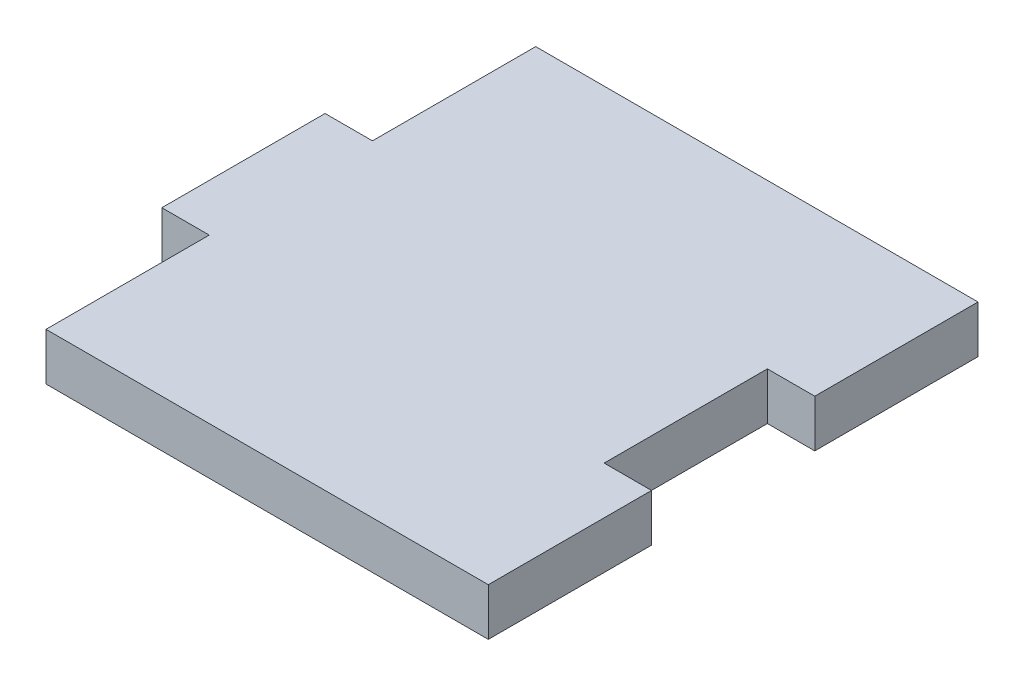
ISO-10303-21;
HEADER;
FILE_DESCRIPTION(('STEP AP214'),'2;1');
FILE_NAME('part.step','',(''),(''),'','','');
FILE_SCHEMA(('AUTOMOTIVE_DESIGN { 1 0 10303 214 1 1 1 1 }'));
ENDSEC;
DATA;
#1=APPLICATION_CONTEXT('core data for automotive mechanical design processes');
#2=APPLICATION_PROTOCOL_DEFINITION('international standard','automotive_design',2000,#1);
#3=PRODUCT_CONTEXT('',#1,'mechanical');
#4=PRODUCT('Part','Part','',(#3));
#5=PRODUCT_RELATED_PRODUCT_CATEGORY('part','',(#4));
#6=PRODUCT_DEFINITION_FORMATION('','',#4);
#7=PRODUCT_DEFINITION_CONTEXT('part definition',#1,'design');
#8=PRODUCT_DEFINITION('design','',#6,#7);
#9=PRODUCT_DEFINITION_SHAPE('','',#8);
#10=(LENGTH_UNIT() NAMED_UNIT(*) SI_UNIT(.MILLI.,.METRE.));
#11=(NAMED_UNIT(*) PLANE_ANGLE_UNIT() SI_UNIT($,.RADIAN.));
#12=(NAMED_UNIT(*) SI_UNIT($,.STERADIAN.) SOLID_ANGLE_UNIT());
#13=UNCERTAINTY_MEASURE_WITH_UNIT(LENGTH_MEASURE(1.E-05),#10,'distance_accuracy_value','');
#14=(GEOMETRIC_REPRESENTATION_CONTEXT(3) GLOBAL_UNCERTAINTY_ASSIGNED_CONTEXT((#13)) GLOBAL_UNIT_ASSIGNED_CONTEXT((#10,
#11,#12)) REPRESENTATION_CONTEXT('',''));
#15=CARTESIAN_POINT('',(0.,0.,0.));
#16=DIRECTION('',(0.,0.,1.));
#17=DIRECTION('',(1.,0.,0.));
#18=AXIS2_PLACEMENT_3D('',#15,#16,#17);
#19=CARTESIAN_POINT('',(-21.,4.5,-31.0000000000017));
#20=DIRECTION('',(1.,0.,0.));
#21=DIRECTION('',(0.,0.,-1.));
#22=AXIS2_PLACEMENT_3D('',#19,#20,#21);
#23=PLANE('',#22);
#24=DIRECTION('',(0.,0.,1.));
#25=VECTOR('',#24,1.);
#26=CARTESIAN_POINT('',(-21.,0.,-31.0000000000017));
#27=LINE('',#26,#25);
#28=CARTESIAN_POINT('',(-21.,0.,-31.0000000000017));
#29=VERTEX_POINT('',#28);
#30=CARTESIAN_POINT('',(-21.0000000000001,0.,-15.5000000000008));
#31=VERTEX_POINT('',#30);
#32=EDGE_CURVE('E240',#29,#31,#27,.T.);
#33=ORIENTED_EDGE('',*,*,#32,.T.);
#34=DIRECTION('',(0.,-1.,0.));
#35=VECTOR('',#34,1.);
#36=CARTESIAN_POINT('',(-21.0000000000001,4.5,-15.5000000000008));
#37=LINE('',#36,#35);
#38=CARTESIAN_POINT('',(-21.0000000000001,4.5,-15.5000000000008));
#39=VERTEX_POINT('',#38);
#40=EDGE_CURVE('E12',#39,#31,#37,.T.);
#41=ORIENTED_EDGE('',*,*,#40,.F.);
#42=DIRECTION('',(0.,0.,1.));
#43=VECTOR('',#42,1.);
#44=CARTESIAN_POINT('',(-21.,4.5,-31.0000000000017));
#45=LINE('',#44,#43);
#46=CARTESIAN_POINT('',(-21.,4.5,-31.0000000000017));
#47=VERTEX_POINT('',#46);
#48=EDGE_CURVE('E166',#47,#39,#45,.T.);
#49=ORIENTED_EDGE('',*,*,#48,.F.);
#50=DIRECTION('',(0.,-1.,0.));
#51=VECTOR('',#50,1.);
#52=CARTESIAN_POINT('',(-21.,4.5,-31.0000000000017));
#53=LINE('',#52,#51);
#54=EDGE_CURVE('E151',#47,#29,#53,.T.);
#55=ORIENTED_EDGE('',*,*,#54,.T.);
#56=EDGE_LOOP('',(#33,#41,#49,#55));
#57=FACE_BOUND('',#56,.T.);
#58=ADVANCED_FACE('F35',(#57),#23,.F.);
#59=CARTESIAN_POINT('',(-25.5000000000001,4.5,-15.5000000000008));
#60=DIRECTION('',(0.,0.,1.));
#61=DIRECTION('',(1.,0.,0.));
#62=AXIS2_PLACEMENT_3D('',#59,#60,#61);
#63=PLANE('',#62);
#64=DIRECTION('',(-1.,0.,0.));
#65=VECTOR('',#64,1.);
#66=CARTESIAN_POINT('',(-25.5000000000001,0.,-15.5000000000008));
#67=LINE('',#66,#65);
#68=CARTESIAN_POINT('',(-25.5000000000001,0.,-15.5000000000008));
#69=VERTEX_POINT('',#68);
#70=EDGE_CURVE('E234',#31,#69,#67,.T.);
#71=ORIENTED_EDGE('',*,*,#70,.T.);
#72=DIRECTION('',(0.,-1.,0.));
#73=VECTOR('',#72,1.);
#74=CARTESIAN_POINT('',(-25.5000000000001,4.5,-15.5000000000008));
#75=LINE('',#74,#73);
#76=CARTESIAN_POINT('',(-25.5000000000001,4.5,-15.5000000000008));
#77=VERTEX_POINT('',#76);
#78=EDGE_CURVE('E43',#77,#69,#75,.T.);
#79=ORIENTED_EDGE('',*,*,#78,.F.);
#80=DIRECTION('',(-1.,0.,0.));
#81=VECTOR('',#80,1.);
#82=CARTESIAN_POINT('',(-25.5000000000001,4.5,-15.5000000000008));
#83=LINE('',#82,#81);
#84=EDGE_CURVE('E107',#39,#77,#83,.T.);
#85=ORIENTED_EDGE('',*,*,#84,.F.);
#86=ORIENTED_EDGE('',*,*,#40,.T.);
#87=EDGE_LOOP('',(#71,#79,#85,#86));
#88=FACE_BOUND('',#87,.T.);
#89=ADVANCED_FACE('F283',(#88),#63,.F.);
#90=CARTESIAN_POINT('',(-25.5000000000001,4.5,-15.5000000000008));
#91=DIRECTION('',(1.,0.,0.));
#92=DIRECTION('',(0.,0.,-1.));
#93=AXIS2_PLACEMENT_3D('',#90,#91,#92);
#94=PLANE('',#93);
#95=DIRECTION('',(0.,0.,1.));
#96=VECTOR('',#95,1.);
#97=CARTESIAN_POINT('',(-25.5000000000001,0.,-15.5000000000008));
#98=LINE('',#97,#96);
#99=CARTESIAN_POINT('',(-25.5,0.,0.));
#100=VERTEX_POINT('',#99);
#101=EDGE_CURVE('E229',#69,#100,#98,.T.);
#102=ORIENTED_EDGE('',*,*,#101,.T.);
#103=DIRECTION('',(0.,-1.,0.));
#104=VECTOR('',#103,1.);
#105=CARTESIAN_POINT('',(-25.5,4.5,0.));
#106=LINE('',#105,#104);
#107=CARTESIAN_POINT('',(-25.5,4.5,0.));
#108=VERTEX_POINT('',#107);
#109=EDGE_CURVE('E221',#108,#100,#106,.T.);
#110=ORIENTED_EDGE('',*,*,#109,.F.);
#111=DIRECTION('',(0.,0.,1.));
#112=VECTOR('',#111,1.);
#113=CARTESIAN_POINT('',(-25.5000000000001,4.5,-15.5000000000008));
#114=LINE('',#113,#112);
#115=EDGE_CURVE('E170',#77,#108,#114,.T.);
#116=ORIENTED_EDGE('',*,*,#115,.F.);
#117=ORIENTED_EDGE('',*,*,#78,.T.);
#118=EDGE_LOOP('',(#102,#110,#116,#117));
#119=FACE_BOUND('',#118,.T.);
#120=ADVANCED_FACE('F227',(#119),#94,.F.);
#121=CARTESIAN_POINT('',(-25.5,4.5,0.));
#122=DIRECTION('',(0.,0.,-1.));
#123=DIRECTION('',(-1.,0.,0.));
#124=AXIS2_PLACEMENT_3D('',#121,#122,#123);
#125=PLANE('',#124);
#126=DIRECTION('',(1.,0.,0.));
#127=VECTOR('',#126,1.);
#128=CARTESIAN_POINT('',(-25.5,0.,0.));
#129=LINE('',#128,#127);
#130=CARTESIAN_POINT('',(-21.,0.,-2.78106847215906E-13));
#131=VERTEX_POINT('',#130);
#132=EDGE_CURVE('E236',#100,#131,#129,.T.);
#133=ORIENTED_EDGE('',*,*,#132,.T.);
#134=DIRECTION('',(0.,-1.,0.));
#135=VECTOR('',#134,1.);
#136=CARTESIAN_POINT('',(-21.,4.5,-2.78106847215906E-13));
#137=LINE('',#136,#135);
#138=CARTESIAN_POINT('',(-21.,4.5,-2.78106847215906E-13));
#139=VERTEX_POINT('',#138);
#140=EDGE_CURVE('E218',#139,#131,#137,.T.);
#141=ORIENTED_EDGE('',*,*,#140,.F.);
#142=DIRECTION('',(1.,0.,0.));
#143=VECTOR('',#142,1.);
#144=CARTESIAN_POINT('',(-25.5,4.5,0.));
#145=LINE('',#144,#143);
#146=EDGE_CURVE('E172',#108,#139,#145,.T.);
#147=ORIENTED_EDGE('',*,*,#146,.F.);
#148=ORIENTED_EDGE('',*,*,#109,.T.);
#149=EDGE_LOOP('',(#133,#141,#147,#148));
#150=FACE_BOUND('',#149,.T.);
#151=ADVANCED_FACE('F262',(#150),#125,.F.);
#152=CARTESIAN_POINT('',(-21.,4.5,-2.78106847215906E-13));
#153=DIRECTION('',(1.,0.,0.));
#154=DIRECTION('',(0.,0.,-1.));
#155=AXIS2_PLACEMENT_3D('',#152,#153,#154);
#156=PLANE('',#155);
#157=DIRECTION('',(0.,0.,1.));
#158=VECTOR('',#157,1.);
#159=CARTESIAN_POINT('',(-21.,0.,-2.78106847215906E-13));
#160=LINE('',#159,#158);
#161=CARTESIAN_POINT('',(-21.,0.,15.5000000000008));
#162=VERTEX_POINT('',#161);
#163=EDGE_CURVE('E238',#131,#162,#160,.T.);
#164=ORIENTED_EDGE('',*,*,#163,.T.);
#165=DIRECTION('',(0.,-1.,0.));
#166=VECTOR('',#165,1.);
#167=CARTESIAN_POINT('',(-21.,4.5,15.5000000000008));
#168=LINE('',#167,#166);
#169=CARTESIAN_POINT('',(-21.,4.5,15.5000000000008));
#170=VERTEX_POINT('',#169);
#171=EDGE_CURVE('E215',#170,#162,#168,.T.);
#172=ORIENTED_EDGE('',*,*,#171,.F.);
#173=DIRECTION('',(0.,0.,1.));
#174=VECTOR('',#173,1.);
#175=CARTESIAN_POINT('',(-21.,4.5,-2.78106847215906E-13));
#176=LINE('',#175,#174);
#177=EDGE_CURVE('E175',#139,#170,#176,.T.);
#178=ORIENTED_EDGE('',*,*,#177,.F.);
#179=ORIENTED_EDGE('',*,*,#140,.T.);
#180=EDGE_LOOP('',(#164,#172,#178,#179));
#181=FACE_BOUND('',#180,.T.);
#182=ADVANCED_FACE('F266',(#181),#156,.F.);
#183=CARTESIAN_POINT('',(16.4999999999993,4.5,15.5000000000008));
#184=DIRECTION('',(0.,0.,-1.));
#185=DIRECTION('',(-1.,0.,0.));
#186=AXIS2_PLACEMENT_3D('',#183,#184,#185);
#187=PLANE('',#186);
#188=DIRECTION('',(1.,0.,0.));
#189=VECTOR('',#188,1.);
#190=CARTESIAN_POINT('',(16.4999999999993,0.,15.5000000000008));
#191=LINE('',#190,#189);
#192=CARTESIAN_POINT('',(21.,0.,15.5000000000008));
#193=VERTEX_POINT('',#192);
#194=EDGE_CURVE('E245',#162,#193,#191,.T.);
#195=ORIENTED_EDGE('',*,*,#194,.T.);
#196=DIRECTION('',(0.,-1.,0.));
#197=VECTOR('',#196,1.);
#198=CARTESIAN_POINT('',(21.,4.5,15.5000000000008));
#199=LINE('',#198,#197);
#200=CARTESIAN_POINT('',(21.,4.5,15.5000000000008));
#201=VERTEX_POINT('',#200);
#202=EDGE_CURVE('E212',#201,#193,#199,.T.);
#203=ORIENTED_EDGE('',*,*,#202,.F.);
#204=DIRECTION('',(1.,0.,0.));
#205=VECTOR('',#204,1.);
#206=CARTESIAN_POINT('',(16.4999999999993,4.5,15.5000000000008));
#207=LINE('',#206,#205);
#208=EDGE_CURVE('E178',#170,#201,#207,.T.);
#209=ORIENTED_EDGE('',*,*,#208,.F.);
#210=ORIENTED_EDGE('',*,*,#171,.T.);
#211=EDGE_LOOP('',(#195,#203,#209,#210));
#212=FACE_BOUND('',#211,.T.);
#213=ADVANCED_FACE('F270',(#212),#187,.F.);
#214=CARTESIAN_POINT('',(21.,4.5,15.5000000000008));
#215=DIRECTION('',(-1.,0.,0.));
#216=DIRECTION('',(0.,0.,1.));
#217=AXIS2_PLACEMENT_3D('',#214,#215,#216);
#218=PLANE('',#217);
#219=DIRECTION('',(0.,0.,-1.));
#220=VECTOR('',#219,1.);
#221=CARTESIAN_POINT('',(21.,0.,15.5000000000008));
#222=LINE('',#221,#220);
#223=CARTESIAN_POINT('',(21.,0.,0.));
#224=VERTEX_POINT('',#223);
#225=EDGE_CURVE('E247',#193,#224,#222,.T.);
#226=ORIENTED_EDGE('',*,*,#225,.T.);
#227=DIRECTION('',(0.,-1.,0.));
#228=VECTOR('',#227,1.);
#229=CARTESIAN_POINT('',(21.,4.5,0.));
#230=LINE('',#229,#228);
#231=CARTESIAN_POINT('',(21.,4.5,0.));
#232=VERTEX_POINT('',#231);
#233=EDGE_CURVE('E204',#232,#224,#230,.T.);
#234=ORIENTED_EDGE('',*,*,#233,.F.);
#235=DIRECTION('',(0.,0.,-1.));
#236=VECTOR('',#235,1.);
#237=CARTESIAN_POINT('',(21.,4.5,15.5000000000008));
#238=LINE('',#237,#236);
#239=EDGE_CURVE('E186',#201,#232,#238,.T.);
#240=ORIENTED_EDGE('',*,*,#239,.F.);
#241=ORIENTED_EDGE('',*,*,#202,.T.);
#242=EDGE_LOOP('',(#226,#234,#240,#241));
#243=FACE_BOUND('',#242,.T.);
#244=ADVANCED_FACE('F273',(#243),#218,.F.);
#245=CARTESIAN_POINT('',(16.4999999999993,4.5,0.));
#246=DIRECTION('',(0.,0.,1.));
#247=DIRECTION('',(1.,0.,0.));
#248=AXIS2_PLACEMENT_3D('',#245,#246,#247);
#249=PLANE('',#248);
#250=DIRECTION('',(-1.,0.,0.));
#251=VECTOR('',#250,1.);
#252=CARTESIAN_POINT('',(16.4999999999993,0.,0.));
#253=LINE('',#252,#251);
#254=CARTESIAN_POINT('',(16.4999999999993,0.,0.));
#255=VERTEX_POINT('',#254);
#256=EDGE_CURVE('E201',#224,#255,#253,.T.);
#257=ORIENTED_EDGE('',*,*,#256,.T.);
#258=DIRECTION('',(0.,-1.,0.));
#259=VECTOR('',#258,1.);
#260=CARTESIAN_POINT('',(16.4999999999993,4.5,0.));
#261=LINE('',#260,#259);
#262=CARTESIAN_POINT('',(16.4999999999993,4.5,0.));
#263=VERTEX_POINT('',#262);
#264=EDGE_CURVE('E198',#263,#255,#261,.T.);
#265=ORIENTED_EDGE('',*,*,#264,.F.);
#266=DIRECTION('',(-1.,0.,0.));
#267=VECTOR('',#266,1.);
#268=CARTESIAN_POINT('',(16.4999999999993,4.5,0.));
#269=LINE('',#268,#267);
#270=EDGE_CURVE('E188',#232,#263,#269,.T.);
#271=ORIENTED_EDGE('',*,*,#270,.F.);
#272=ORIENTED_EDGE('',*,*,#233,.T.);
#273=EDGE_LOOP('',(#257,#265,#271,#272));
#274=FACE_BOUND('',#273,.T.);
#275=ADVANCED_FACE('F199',(#274),#249,.F.);
#276=CARTESIAN_POINT('',(16.4999999999993,4.5,0.));
#277=DIRECTION('',(-1.,0.,0.));
#278=DIRECTION('',(0.,0.,1.));
#279=AXIS2_PLACEMENT_3D('',#276,#277,#278);
#280=PLANE('',#279);
#281=DIRECTION('',(0.,0.,-1.));
#282=VECTOR('',#281,1.);
#283=CARTESIAN_POINT('',(16.4999999999993,0.,0.));
#284=LINE('',#283,#282);
#285=CARTESIAN_POINT('',(16.4999999999993,0.,-15.5000000000008));
#286=VERTEX_POINT('',#285);
#287=EDGE_CURVE('E207',#255,#286,#284,.T.);
#288=ORIENTED_EDGE('',*,*,#287,.T.);
#289=DIRECTION('',(0.,-1.,0.));
#290=VECTOR('',#289,1.);
#291=CARTESIAN_POINT('',(16.4999999999993,4.5,-15.5000000000008));
#292=LINE('',#291,#290);
#293=CARTESIAN_POINT('',(16.4999999999993,4.5,-15.5000000000008));
#294=VERTEX_POINT('',#293);
#295=EDGE_CURVE('E146',#294,#286,#292,.T.);
#296=ORIENTED_EDGE('',*,*,#295,.F.);
#297=DIRECTION('',(0.,0.,-1.));
#298=VECTOR('',#297,1.);
#299=CARTESIAN_POINT('',(16.4999999999993,4.5,0.));
#300=LINE('',#299,#298);
#301=EDGE_CURVE('E137',#263,#294,#300,.T.);
#302=ORIENTED_EDGE('',*,*,#301,.F.);
#303=ORIENTED_EDGE('',*,*,#264,.T.);
#304=EDGE_LOOP('',(#288,#296,#302,#303));
#305=FACE_BOUND('',#304,.T.);
#306=ADVANCED_FACE('F206',(#305),#280,.F.);
#307=CARTESIAN_POINT('',(16.4999999999993,4.5,-15.5000000000008));
#308=DIRECTION('',(0.,0.,-1.));
#309=DIRECTION('',(-1.,0.,0.));
#310=AXIS2_PLACEMENT_3D('',#307,#308,#309);
#311=PLANE('',#310);
#312=DIRECTION('',(1.,0.,0.));
#313=VECTOR('',#312,1.);
#314=CARTESIAN_POINT('',(16.4999999999993,0.,-15.5000000000008));
#315=LINE('',#314,#313);
#316=CARTESIAN_POINT('',(21.,0.,-15.5000000000008));
#317=VERTEX_POINT('',#316);
#318=EDGE_CURVE('E145',#286,#317,#315,.T.);
#319=ORIENTED_EDGE('',*,*,#318,.T.);
#320=DIRECTION('',(0.,-1.,0.));
#321=VECTOR('',#320,1.);
#322=CARTESIAN_POINT('',(21.,4.5,-15.5000000000008));
#323=LINE('',#322,#321);
#324=CARTESIAN_POINT('',(21.,4.5,-15.5000000000008));
#325=VERTEX_POINT('',#324);
#326=EDGE_CURVE('E142',#325,#317,#323,.T.);
#327=ORIENTED_EDGE('',*,*,#326,.F.);
#328=DIRECTION('',(1.,0.,0.));
#329=VECTOR('',#328,1.);
#330=CARTESIAN_POINT('',(16.4999999999993,4.5,-15.5000000000008));
#331=LINE('',#330,#329);
#332=EDGE_CURVE('E130',#294,#325,#331,.T.);
#333=ORIENTED_EDGE('',*,*,#332,.F.);
#334=ORIENTED_EDGE('',*,*,#295,.T.);
#335=EDGE_LOOP('',(#319,#327,#333,#334));
#336=FACE_BOUND('',#335,.T.);
#337=ADVANCED_FACE('F143',(#336),#311,.F.);
#338=CARTESIAN_POINT('',(21.,4.5,-15.5000000000008));
#339=DIRECTION('',(-1.,0.,0.));
#340=DIRECTION('',(0.,0.,1.));
#341=AXIS2_PLACEMENT_3D('',#338,#339,#340);
#342=PLANE('',#341);
#343=DIRECTION('',(0.,0.,-1.));
#344=VECTOR('',#343,1.);
#345=CARTESIAN_POINT('',(21.,0.,-15.5000000000008));
#346=LINE('',#345,#344);
#347=CARTESIAN_POINT('',(21.,0.,-31.0000000000017));
#348=VERTEX_POINT('',#347);
#349=EDGE_CURVE('E93',#317,#348,#346,.T.);
#350=ORIENTED_EDGE('',*,*,#349,.T.);
#351=DIRECTION('',(0.,-1.,0.));
#352=VECTOR('',#351,1.);
#353=CARTESIAN_POINT('',(21.,4.5,-31.0000000000017));
#354=LINE('',#353,#352);
#355=CARTESIAN_POINT('',(21.,4.5,-31.0000000000017));
#356=VERTEX_POINT('',#355);
#357=EDGE_CURVE('E147',#356,#348,#354,.T.);
#358=ORIENTED_EDGE('',*,*,#357,.F.);
#359=DIRECTION('',(0.,0.,-1.));
#360=VECTOR('',#359,1.);
#361=CARTESIAN_POINT('',(21.,4.5,-15.5000000000008));
#362=LINE('',#361,#360);
#363=EDGE_CURVE('E135',#325,#356,#362,.T.);
#364=ORIENTED_EDGE('',*,*,#363,.F.);
#365=ORIENTED_EDGE('',*,*,#326,.T.);
#366=EDGE_LOOP('',(#350,#358,#364,#365));
#367=FACE_BOUND('',#366,.T.);
#368=ADVANCED_FACE('F149',(#367),#342,.F.);
#369=CARTESIAN_POINT('',(-21.,4.5,-31.0000000000017));
#370=DIRECTION('',(0.,0.,1.));
#371=DIRECTION('',(1.,0.,0.));
#372=AXIS2_PLACEMENT_3D('',#369,#370,#371);
#373=PLANE('',#372);
#374=DIRECTION('',(-1.,0.,0.));
#375=VECTOR('',#374,1.);
#376=CARTESIAN_POINT('',(-21.,0.,-31.0000000000017));
#377=LINE('',#376,#375);
#378=EDGE_CURVE('E99',#348,#29,#377,.T.);
#379=ORIENTED_EDGE('',*,*,#378,.T.);
#380=ORIENTED_EDGE('',*,*,#54,.F.);
#381=DIRECTION('',(-1.,0.,0.));
#382=VECTOR('',#381,1.);
#383=CARTESIAN_POINT('',(-21.,4.5,-31.0000000000017));
#384=LINE('',#383,#382);
#385=EDGE_CURVE('E51',#356,#47,#384,.T.);
#386=ORIENTED_EDGE('',*,*,#385,.F.);
#387=ORIENTED_EDGE('',*,*,#357,.T.);
#388=EDGE_LOOP('',(#379,#380,#386,#387));
#389=FACE_BOUND('',#388,.T.);
#390=ADVANCED_FACE('F254',(#389),#373,.F.);
#391=CARTESIAN_POINT('',(0.,4.5,0.));
#392=DIRECTION('',(0.,1.,0.));
#393=DIRECTION('',(0.,0.,1.));
#394=AXIS2_PLACEMENT_3D('',#391,#392,#393);
#395=PLANE('',#394);
#396=ORIENTED_EDGE('',*,*,#177,.T.);
#397=ORIENTED_EDGE('',*,*,#208,.T.);
#398=ORIENTED_EDGE('',*,*,#239,.T.);
#399=ORIENTED_EDGE('',*,*,#270,.T.);
#400=ORIENTED_EDGE('',*,*,#301,.T.);
#401=ORIENTED_EDGE('',*,*,#332,.T.);
#402=ORIENTED_EDGE('',*,*,#363,.T.);
#403=ORIENTED_EDGE('',*,*,#385,.T.);
#404=ORIENTED_EDGE('',*,*,#48,.T.);
#405=ORIENTED_EDGE('',*,*,#84,.T.);
#406=ORIENTED_EDGE('',*,*,#115,.T.);
#407=ORIENTED_EDGE('',*,*,#146,.T.);
#408=EDGE_LOOP('',(#396,#397,#398,#399,#400,#401,#402,#403,#404,#405,#406,#407));
#409=FACE_BOUND('',#408,.T.);
#410=ADVANCED_FACE('F133',(#409),#395,.T.);
#411=CARTESIAN_POINT('',(0.,0.,0.));
#412=DIRECTION('',(0.,1.,0.));
#413=DIRECTION('',(0.,0.,1.));
#414=AXIS2_PLACEMENT_3D('',#411,#412,#413);
#415=PLANE('',#414);
#416=ORIENTED_EDGE('',*,*,#194,.F.);
#417=ORIENTED_EDGE('',*,*,#163,.F.);
#418=ORIENTED_EDGE('',*,*,#132,.F.);
#419=ORIENTED_EDGE('',*,*,#101,.F.);
#420=ORIENTED_EDGE('',*,*,#70,.F.);
#421=ORIENTED_EDGE('',*,*,#32,.F.);
#422=ORIENTED_EDGE('',*,*,#378,.F.);
#423=ORIENTED_EDGE('',*,*,#349,.F.);
#424=ORIENTED_EDGE('',*,*,#318,.F.);
#425=ORIENTED_EDGE('',*,*,#287,.F.);
#426=ORIENTED_EDGE('',*,*,#256,.F.);
#427=ORIENTED_EDGE('',*,*,#225,.F.);
#428=EDGE_LOOP('',(#416,#417,#418,#419,#420,#421,#422,#423,#424,#425,#426,#427));
#429=FACE_BOUND('',#428,.T.);
#430=ADVANCED_FACE('F232',(#429),#415,.F.);
#431=CLOSED_SHELL('',(#58,#89,#120,#151,#182,#213,#244,#275,#306,#337,#368,#390,#410,#430));
#432=MANIFOLD_SOLID_BREP('B2',#431);
#433=ADVANCED_BREP_SHAPE_REPRESENTATION('',(#18,#432),#14);
#434=SHAPE_DEFINITION_REPRESENTATION(#9,#433);
ENDSEC;
END-ISO-10303-21;
